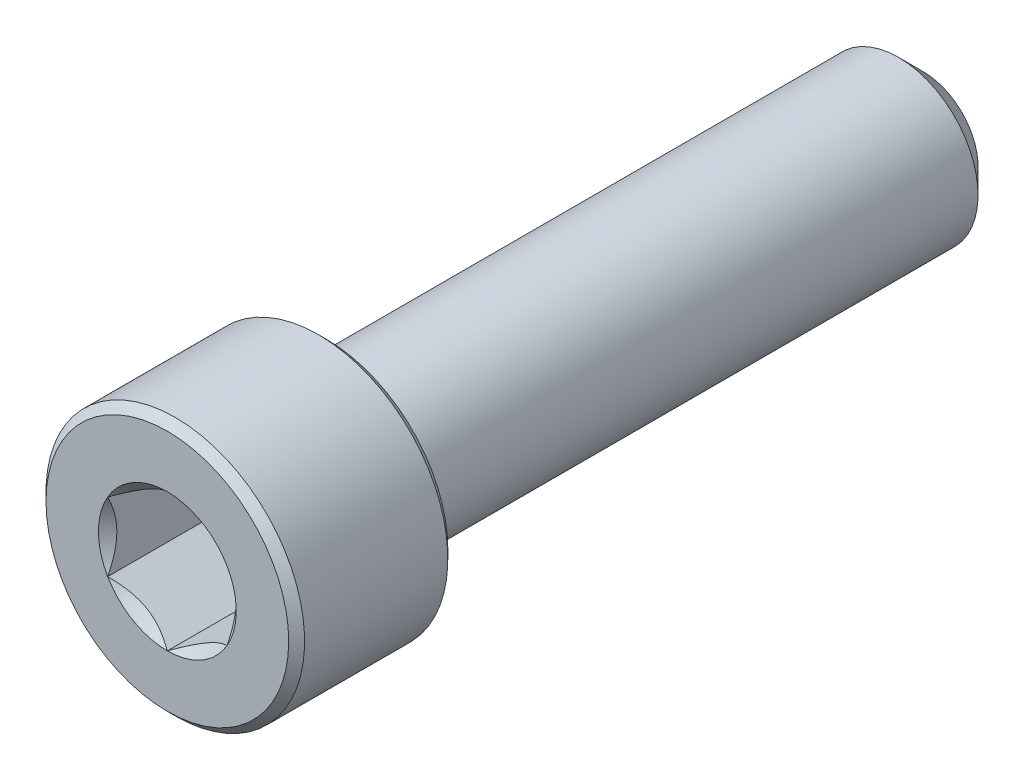
ISO-10303-21;
HEADER;
FILE_DESCRIPTION(('STEP AP214'),'2;1');
FILE_NAME('part.step','',(''),(''),'','','');
FILE_SCHEMA(('AUTOMOTIVE_DESIGN { 1 0 10303 214 1 1 1 1 }'));
ENDSEC;
DATA;
#1=APPLICATION_CONTEXT('core data for automotive mechanical design processes');
#2=APPLICATION_PROTOCOL_DEFINITION('international standard','automotive_design',2000,#1);
#3=PRODUCT_CONTEXT('',#1,'mechanical');
#4=PRODUCT('Part','Part','',(#3));
#5=PRODUCT_RELATED_PRODUCT_CATEGORY('part','',(#4));
#6=PRODUCT_DEFINITION_FORMATION('','',#4);
#7=PRODUCT_DEFINITION_CONTEXT('part definition',#1,'design');
#8=PRODUCT_DEFINITION('design','',#6,#7);
#9=PRODUCT_DEFINITION_SHAPE('','',#8);
#10=(LENGTH_UNIT() NAMED_UNIT(*) SI_UNIT(.MILLI.,.METRE.));
#11=(NAMED_UNIT(*) PLANE_ANGLE_UNIT() SI_UNIT($,.RADIAN.));
#12=(NAMED_UNIT(*) SI_UNIT($,.STERADIAN.) SOLID_ANGLE_UNIT());
#13=UNCERTAINTY_MEASURE_WITH_UNIT(LENGTH_MEASURE(1.E-05),#10,'distance_accuracy_value','');
#14=(GEOMETRIC_REPRESENTATION_CONTEXT(3) GLOBAL_UNCERTAINTY_ASSIGNED_CONTEXT((#13)) GLOBAL_UNIT_ASSIGNED_CONTEXT((#10,
#11,#12)) REPRESENTATION_CONTEXT('',''));
#15=CARTESIAN_POINT('',(0.,0.,0.));
#16=DIRECTION('',(0.,0.,1.));
#17=DIRECTION('',(1.,0.,0.));
#18=AXIS2_PLACEMENT_3D('',#15,#16,#17);
#19=CARTESIAN_POINT('',(0.,0.,19.));
#20=DIRECTION('',(0.,0.,1.));
#21=DIRECTION('',(0.,-1.,0.));
#22=AXIS2_PLACEMENT_3D('',#19,#20,#21);
#23=PLANE('',#22);
#24=CARTESIAN_POINT('',(0.,0.,19.));
#25=DIRECTION('',(0.,0.,1.));
#26=DIRECTION('',(1.,0.,0.));
#27=AXIS2_PLACEMENT_3D('',#24,#25,#26);
#28=CIRCLE('',#27,3.46410161513775);
#29=CARTESIAN_POINT('',(0.,-3.46410161513776,19.));
#30=VERTEX_POINT('',#29);
#31=CARTESIAN_POINT('',(3.,-1.73205080756888,19.));
#32=VERTEX_POINT('',#31);
#33=EDGE_CURVE('E99',#30,#32,#28,.T.);
#34=ORIENTED_EDGE('',*,*,#33,.F.);
#35=CARTESIAN_POINT('',(-3.,-1.73205080756888,19.));
#36=VERTEX_POINT('',#35);
#37=EDGE_CURVE('E269',#36,#30,#28,.T.);
#38=ORIENTED_EDGE('',*,*,#37,.F.);
#39=CARTESIAN_POINT('',(-3.,1.73205080756888,19.));
#40=VERTEX_POINT('',#39);
#41=EDGE_CURVE('E134',#40,#36,#28,.T.);
#42=ORIENTED_EDGE('',*,*,#41,.F.);
#43=CARTESIAN_POINT('',(0.,3.46410161513775,19.));
#44=VERTEX_POINT('',#43);
#45=EDGE_CURVE('E130',#44,#40,#28,.T.);
#46=ORIENTED_EDGE('',*,*,#45,.F.);
#47=CARTESIAN_POINT('',(3.,1.73205080756888,19.));
#48=VERTEX_POINT('',#47);
#49=EDGE_CURVE('E101',#48,#44,#28,.T.);
#50=ORIENTED_EDGE('',*,*,#49,.F.);
#51=EDGE_CURVE('E93',#32,#48,#28,.T.);
#52=ORIENTED_EDGE('',*,*,#51,.F.);
#53=EDGE_LOOP('',(#34,#38,#42,#46,#50,#52));
#54=FACE_BOUND('',#53,.T.);
#55=CARTESIAN_POINT('',(0.,0.,19.));
#56=DIRECTION('',(0.,0.,-1.));
#57=DIRECTION('',(0.,1.,0.));
#58=AXIS2_PLACEMENT_3D('',#55,#56,#57);
#59=CIRCLE('',#58,6.1);
#60=CARTESIAN_POINT('',(0.,6.1,19.));
#61=VERTEX_POINT('',#60);
#62=EDGE_CURVE('E49',#61,#61,#59,.T.);
#63=ORIENTED_EDGE('',*,*,#62,.F.);
#64=EDGE_LOOP('',(#63));
#65=FACE_BOUND('',#64,.T.);
#66=ADVANCED_FACE('F36',(#54,#65),#23,.T.);
#67=CARTESIAN_POINT('',(0.,0.,18.6));
#68=DIRECTION('',(0.,0.,-1.));
#69=DIRECTION('',(0.,1.,0.));
#70=AXIS2_PLACEMENT_3D('',#67,#68,#69);
#71=CONICAL_SURFACE('',#70,6.5,0.785398163397452);
#72=ORIENTED_EDGE('',*,*,#62,.T.);
#73=EDGE_LOOP('',(#72));
#74=FACE_BOUND('',#73,.T.);
#75=CARTESIAN_POINT('',(0.,0.,18.6));
#76=DIRECTION('',(0.,0.,-1.));
#77=DIRECTION('',(0.,1.,0.));
#78=AXIS2_PLACEMENT_3D('',#75,#76,#77);
#79=CIRCLE('',#78,6.5);
#80=CARTESIAN_POINT('',(0.,6.5,18.6));
#81=VERTEX_POINT('',#80);
#82=EDGE_CURVE('E220',#81,#81,#79,.T.);
#83=ORIENTED_EDGE('',*,*,#82,.F.);
#84=EDGE_LOOP('',(#83));
#85=FACE_BOUND('',#84,.T.);
#86=ADVANCED_FACE('F208',(#74,#85),#71,.T.);
#87=CARTESIAN_POINT('',(0.,0.,-19.));
#88=DIRECTION('',(0.,0.,-1.));
#89=DIRECTION('',(0.,1.,0.));
#90=AXIS2_PLACEMENT_3D('',#87,#88,#89);
#91=CYLINDRICAL_SURFACE('',#90,6.5);
#92=ORIENTED_EDGE('',*,*,#82,.T.);
#93=EDGE_LOOP('',(#92));
#94=FACE_BOUND('',#93,.T.);
#95=CARTESIAN_POINT('',(0.,0.,11.4));
#96=DIRECTION('',(0.,0.,-1.));
#97=DIRECTION('',(0.,1.,0.));
#98=AXIS2_PLACEMENT_3D('',#95,#96,#97);
#99=CIRCLE('',#98,6.5);
#100=CARTESIAN_POINT('',(0.,6.5,11.4));
#101=VERTEX_POINT('',#100);
#102=EDGE_CURVE('E221',#101,#101,#99,.T.);
#103=ORIENTED_EDGE('',*,*,#102,.F.);
#104=EDGE_LOOP('',(#103));
#105=FACE_BOUND('',#104,.T.);
#106=ADVANCED_FACE('F205',(#94,#105),#91,.T.);
#107=CARTESIAN_POINT('',(0.,0.,11.));
#108=DIRECTION('',(0.,0.,1.));
#109=DIRECTION('',(0.,-1.,0.));
#110=AXIS2_PLACEMENT_3D('',#107,#108,#109);
#111=CONICAL_SURFACE('',#110,6.1,0.785398163397452);
#112=ORIENTED_EDGE('',*,*,#102,.T.);
#113=EDGE_LOOP('',(#112));
#114=FACE_BOUND('',#113,.T.);
#115=CARTESIAN_POINT('',(0.,0.,11.));
#116=DIRECTION('',(0.,0.,-1.));
#117=DIRECTION('',(0.,1.,0.));
#118=AXIS2_PLACEMENT_3D('',#115,#116,#117);
#119=CIRCLE('',#118,6.1);
#120=CARTESIAN_POINT('',(0.,6.1,11.));
#121=VERTEX_POINT('',#120);
#122=EDGE_CURVE('E224',#121,#121,#119,.T.);
#123=ORIENTED_EDGE('',*,*,#122,.F.);
#124=EDGE_LOOP('',(#123));
#125=FACE_BOUND('',#124,.T.);
#126=ADVANCED_FACE('F201',(#114,#125),#111,.T.);
#127=CARTESIAN_POINT('',(0.,6.1,11.));
#128=DIRECTION('',(0.,0.,-1.));
#129=DIRECTION('',(0.,1.,0.));
#130=AXIS2_PLACEMENT_3D('',#127,#128,#129);
#131=PLANE('',#130);
#132=ORIENTED_EDGE('',*,*,#122,.T.);
#133=EDGE_LOOP('',(#132));
#134=FACE_BOUND('',#133,.T.);
#135=CARTESIAN_POINT('',(0.,0.,11.));
#136=DIRECTION('',(0.,0.,-1.));
#137=DIRECTION('',(0.,1.,0.));
#138=AXIS2_PLACEMENT_3D('',#135,#136,#137);
#139=CIRCLE('',#138,4.);
#140=CARTESIAN_POINT('',(0.,4.,11.));
#141=VERTEX_POINT('',#140);
#142=EDGE_CURVE('E229',#141,#141,#139,.T.);
#143=ORIENTED_EDGE('',*,*,#142,.F.);
#144=EDGE_LOOP('',(#143));
#145=FACE_BOUND('',#144,.T.);
#146=ADVANCED_FACE('F197',(#134,#145),#131,.T.);
#147=CARTESIAN_POINT('',(0.,0.,-19.));
#148=DIRECTION('',(0.,0.,-1.));
#149=DIRECTION('',(0.,1.,0.));
#150=AXIS2_PLACEMENT_3D('',#147,#148,#149);
#151=CYLINDRICAL_SURFACE('',#150,4.);
#152=ORIENTED_EDGE('',*,*,#142,.T.);
#153=EDGE_LOOP('',(#152));
#154=FACE_BOUND('',#153,.T.);
#155=CARTESIAN_POINT('',(0.,0.,-17.75));
#156=DIRECTION('',(0.,0.,-1.));
#157=DIRECTION('',(0.,1.,0.));
#158=AXIS2_PLACEMENT_3D('',#155,#156,#157);
#159=CIRCLE('',#158,4.);
#160=CARTESIAN_POINT('',(0.,4.,-17.75));
#161=VERTEX_POINT('',#160);
#162=EDGE_CURVE('E232',#161,#161,#159,.T.);
#163=ORIENTED_EDGE('',*,*,#162,.F.);
#164=EDGE_LOOP('',(#163));
#165=FACE_BOUND('',#164,.T.);
#166=ADVANCED_FACE('F193',(#154,#165),#151,.T.);
#167=CARTESIAN_POINT('',(0.,0.,-19.));
#168=DIRECTION('',(0.,0.,1.));
#169=DIRECTION('',(0.,-1.,0.));
#170=AXIS2_PLACEMENT_3D('',#167,#168,#169);
#171=CONICAL_SURFACE('',#170,2.75,0.785398163397442);
#172=ORIENTED_EDGE('',*,*,#162,.T.);
#173=EDGE_LOOP('',(#172));
#174=FACE_BOUND('',#173,.T.);
#175=CARTESIAN_POINT('',(0.,0.,-19.));
#176=DIRECTION('',(0.,0.,-1.));
#177=DIRECTION('',(0.,1.,0.));
#178=AXIS2_PLACEMENT_3D('',#175,#176,#177);
#179=CIRCLE('',#178,2.75);
#180=CARTESIAN_POINT('',(0.,2.75,-19.));
#181=VERTEX_POINT('',#180);
#182=EDGE_CURVE('E235',#181,#181,#179,.T.);
#183=ORIENTED_EDGE('',*,*,#182,.F.);
#184=EDGE_LOOP('',(#183));
#185=FACE_BOUND('',#184,.T.);
#186=ADVANCED_FACE('F189',(#174,#185),#171,.T.);
#187=CARTESIAN_POINT('',(0.,2.75,-19.));
#188=DIRECTION('',(0.,0.,-1.));
#189=DIRECTION('',(0.,1.,0.));
#190=AXIS2_PLACEMENT_3D('',#187,#188,#189);
#191=PLANE('',#190);
#192=ORIENTED_EDGE('',*,*,#182,.T.);
#193=EDGE_LOOP('',(#192));
#194=FACE_BOUND('',#193,.T.);
#195=ADVANCED_FACE('F186',(#194),#191,.T.);
#196=CARTESIAN_POINT('',(0.,0.,19.));
#197=DIRECTION('',(0.,0.,1.));
#198=DIRECTION('',(1.,0.,0.));
#199=AXIS2_PLACEMENT_3D('',#196,#197,#198);
#200=CONICAL_SURFACE('',#199,3.46410161513775,0.78539816339745);
#201=ORIENTED_EDGE('',*,*,#33,.T.);
#202=CARTESIAN_POINT('',(-0.00019999999999857,-3.46421708519159,19.0001154758271));
#203=CARTESIAN_POINT('',(0.10292351495575,-3.40467869607211,18.9406283183218));
#204=CARTESIAN_POINT('',(0.207771389330652,-3.3441447475778,18.8846349794655));
#205=CARTESIAN_POINT('',(0.421567671781098,-3.22070940635329,18.7821125963789));
#206=CARTESIAN_POINT('',(0.530536411379762,-3.15779627521275,18.7356405937413));
#207=CARTESIAN_POINT('',(0.750266639597031,-3.03093496880241,18.6560331885163));
#208=CARTESIAN_POINT('',(0.860972171762214,-2.96701910000606,18.6226977006427));
#209=CARTESIAN_POINT('',(1.08482041056533,-2.83778025907546,18.5713375439793));
#210=CARTESIAN_POINT('',(1.197956279207,-2.77246123486019,18.5532745375356));
#211=CARTESIAN_POINT('',(1.3929409561927,-2.65988677911464,18.5369769084505));
#212=CARTESIAN_POINT('',(1.47453795400214,-2.6127767304643,18.5345643671738));
#213=CARTESIAN_POINT('',(1.63759922883009,-2.51863325954798,18.5386294346571));
#214=CARTESIAN_POINT('',(1.71906344929899,-2.47159986993094,18.5451101600283));
#215=CARTESIAN_POINT('',(1.88122011233837,-2.37797867687426,18.5665917225152));
#216=CARTESIAN_POINT('',(1.96191158878431,-2.33139143122689,18.5816020899673));
#217=CARTESIAN_POINT('',(2.12190869789134,-2.23901705721438,18.619323646066));
#218=CARTESIAN_POINT('',(2.2012144363093,-2.19322986779049,18.6420342443228));
#219=CARTESIAN_POINT('',(2.34200614080276,-2.11194373930153,18.6887606848539));
#220=CARTESIAN_POINT('',(2.40380372214603,-2.07626488907772,18.7115483276808));
#221=CARTESIAN_POINT('',(2.52628941752022,-2.00554773988155,18.7607962860574));
#222=CARTESIAN_POINT('',(2.58697749763561,-1.97050946049033,18.7872567136662));
#223=CARTESIAN_POINT('',(2.70705299739086,-1.90118383838356,18.8432569943914));
#224=CARTESIAN_POINT('',(2.76644383229592,-1.86689452386373,18.8727871644784));
#225=CARTESIAN_POINT('',(2.88412556146727,-1.79895094584795,18.9345390915755));
#226=CARTESIAN_POINT('',(2.94241710424773,-1.76529630793217,18.9667591966594));
#227=CARTESIAN_POINT('',(3.0002,-1.73193533751504,19.0001154758271));
#228=B_SPLINE_CURVE_WITH_KNOTS('',3,(#202,#203,#204,#205,#206,#207,#208,#209,#210,#211,#212,
#213,#214,#215,#216,#217,#218,#219,#220,#221,#222,#223,#224,#225,#226,#227),.UNSPECIFIED.,.F.,
.F.,(4,2,2,2,2,2,2,2,2,2,2,2,4),(0.,0.399603557139306,0.801535286397846,1.19708369162343,
1.59163620080173,1.87398941755844,2.15644160919093,2.43921001247425,2.72195674032138,
2.94657516661927,3.17120044767274,3.3951375283781,3.61893808380739),.UNSPECIFIED.);
#229=EDGE_CURVE('E12',#30,#32,#228,.T.);
#230=ORIENTED_EDGE('',*,*,#229,.F.);
#231=EDGE_LOOP('',(#201,#230));
#232=FACE_BOUND('',#231,.T.);
#233=ADVANCED_FACE('F152',(#232),#200,.F.);
#234=ORIENTED_EDGE('',*,*,#37,.T.);
#235=CARTESIAN_POINT('',(-3.0002,-1.73193533751504,19.0001154758271));
#236=CARTESIAN_POINT('',(-2.89707648504425,-1.79147372663452,18.9406283183218));
#237=CARTESIAN_POINT('',(-2.79222861066935,-1.85200767512883,18.8846349794655));
#238=CARTESIAN_POINT('',(-2.5784323282189,-1.97544301635334,18.7821125963789));
#239=CARTESIAN_POINT('',(-2.46946358862024,-2.03835614749388,18.7356405937413));
#240=CARTESIAN_POINT('',(-2.24973336040297,-2.16521745390422,18.6560331885163));
#241=CARTESIAN_POINT('',(-2.13902782823779,-2.22913332270057,18.6226977006427));
#242=CARTESIAN_POINT('',(-1.91517958943467,-2.35837216363117,18.5713375439793));
#243=CARTESIAN_POINT('',(-1.802043720793,-2.42369118784644,18.5532745375356));
#244=CARTESIAN_POINT('',(-1.6070590438073,-2.53626564359199,18.5369769084505));
#245=CARTESIAN_POINT('',(-1.52546204599786,-2.58337569224233,18.5345643671738));
#246=CARTESIAN_POINT('',(-1.36240077116991,-2.67751916315865,18.5386294346571));
#247=CARTESIAN_POINT('',(-1.28093655070101,-2.7245525527757,18.5451101600283));
#248=CARTESIAN_POINT('',(-1.11877988766163,-2.81817374583238,18.5665917225152));
#249=CARTESIAN_POINT('',(-1.03808841121569,-2.86476099147974,18.5816020899673));
#250=CARTESIAN_POINT('',(-0.878091302108662,-2.95713536549225,18.619323646066));
#251=CARTESIAN_POINT('',(-0.798785563690701,-3.00292255491614,18.6420342443228));
#252=CARTESIAN_POINT('',(-0.657993859197244,-3.0842086834051,18.6887606848539));
#253=CARTESIAN_POINT('',(-0.596196277853971,-3.11988753362891,18.7115483276808));
#254=CARTESIAN_POINT('',(-0.473710582479778,-3.19060468282508,18.7607962860574));
#255=CARTESIAN_POINT('',(-0.413022502364395,-3.2256429622163,18.7872567136662));
#256=CARTESIAN_POINT('',(-0.292947002609136,-3.29496858432308,18.8432569943914));
#257=CARTESIAN_POINT('',(-0.233556167704082,-3.32925789884291,18.8727871644784));
#258=CARTESIAN_POINT('',(-0.115874438532732,-3.39720147685869,18.9345390915755));
#259=CARTESIAN_POINT('',(-0.0575828957522662,-3.43085611477447,18.9667591966594));
#260=CARTESIAN_POINT('',(0.000199999999999969,-3.46421708519159,19.0001154758271));
#261=B_SPLINE_CURVE_WITH_KNOTS('',3,(#235,#236,#237,#238,#239,#240,#241,#242,#243,#244,#245,
#246,#247,#248,#249,#250,#251,#252,#253,#254,#255,#256,#257,#258,#259,#260),.UNSPECIFIED.,.F.,
.F.,(4,2,2,2,2,2,2,2,2,2,2,2,4),(0.,0.399603557139308,0.801535286397846,1.19708369162343,
1.59163620080173,1.87398941755844,2.15644160919093,2.43921001247425,2.72195674032138,
2.94657516661927,3.17120044767274,3.3951375283781,3.61893808380739),.UNSPECIFIED.);
#262=EDGE_CURVE('E131',#36,#30,#261,.T.);
#263=ORIENTED_EDGE('',*,*,#262,.F.);
#264=EDGE_LOOP('',(#234,#263));
#265=FACE_BOUND('',#264,.T.);
#266=ADVANCED_FACE('F267',(#265),#200,.F.);
#267=ORIENTED_EDGE('',*,*,#41,.T.);
#268=CARTESIAN_POINT('',(-3.,-3.45441625939385,20.1111570325416));
#269=CARTESIAN_POINT('',(-3.,-3.37030502107638,20.0476657232794));
#270=CARTESIAN_POINT('',(-3.,-3.28572284861355,19.9847881417678));
#271=CARTESIAN_POINT('',(-3.,-3.11543086688957,19.8605352202182));
#272=CARTESIAN_POINT('',(-3.,-3.02972077988559,19.7991602612535));
#273=CARTESIAN_POINT('',(-3.,-2.8563602330365,19.6777509975778));
#274=CARTESIAN_POINT('',(-3.,-2.76869988431322,19.6177307653415));
#275=CARTESIAN_POINT('',(-3.,-2.5918912487671,19.4999306126985));
#276=CARTESIAN_POINT('',(-3.,-2.50274306770574,19.4421505340141));
#277=CARTESIAN_POINT('',(-3.,-2.31756329845857,19.3260958713429));
#278=CARTESIAN_POINT('',(-3.,-2.22143002198058,19.2679827190468));
#279=CARTESIAN_POINT('',(-3.,-2.02694739151963,19.1555968716429));
#280=CARTESIAN_POINT('',(-3.,-1.92859833207453,19.101323670026));
#281=CARTESIAN_POINT('',(-3.,-1.7296520236116,18.9977624496109));
#282=CARTESIAN_POINT('',(-3.,-1.62906211119816,18.9484604472253));
#283=CARTESIAN_POINT('',(-3.,-1.42513893302447,18.855954239299));
#284=CARTESIAN_POINT('',(-3.,-1.3218069347663,18.8127472727735));
#285=CARTESIAN_POINT('',(-3.,-1.12067434078031,18.7371396932414));
#286=CARTESIAN_POINT('',(-3.,-1.02309778507454,18.7041492645284));
#287=CARTESIAN_POINT('',(-3.,-0.825595420969993,18.6459965369441));
#288=CARTESIAN_POINT('',(-3.,-0.725669451239074,18.620834777359));
#289=CARTESIAN_POINT('',(-3.,-0.525726947792027,18.5800719953195));
#290=CARTESIAN_POINT('',(-3.,-0.425744363617326,18.5643071649568));
#291=CARTESIAN_POINT('',(-3.,-0.224710351161198,18.5426442284558));
#292=CARTESIAN_POINT('',(-3.,-0.123659109618514,18.5367444262465));
#293=CARTESIAN_POINT('',(-3.,0.0748582819677237,18.5352497065848));
#294=CARTESIAN_POINT('',(-3.,0.172321806608345,18.5392895256711));
#295=CARTESIAN_POINT('',(-3.,0.366414003342316,18.5566450472329));
#296=CARTESIAN_POINT('',(-3.,0.463042593410415,18.5699616508163));
#297=CARTESIAN_POINT('',(-3.,0.656399252511053,18.6053707356158));
#298=CARTESIAN_POINT('',(-3.,0.753099531688679,18.6276125600194));
#299=CARTESIAN_POINT('',(-3.,0.944393095040882,18.6796858906705));
#300=CARTESIAN_POINT('',(-3.,1.03898655479587,18.7095167618603));
#301=CARTESIAN_POINT('',(-3.,1.23463961000382,18.7786113636965));
#302=CARTESIAN_POINT('',(-3.,1.33547771428671,18.8184959734906));
#303=CARTESIAN_POINT('',(-3.,1.53452137874292,18.9043830232129));
#304=CARTESIAN_POINT('',(-3.,1.63272604345161,18.9503875132043));
#305=CARTESIAN_POINT('',(-3.,1.82700394280656,19.0474277014877));
#306=CARTESIAN_POINT('',(-3.,1.92306904045365,19.0984795592876));
#307=CARTESIAN_POINT('',(-3.,2.11298650428611,19.2044820100322));
#308=CARTESIAN_POINT('',(-3.,2.20683926516496,19.259431900424));
#309=CARTESIAN_POINT('',(-3.,2.38800606865125,19.3696520775105));
#310=CARTESIAN_POINT('',(-3.,2.47541308656128,19.4247703488088));
#311=CARTESIAN_POINT('',(-3.,2.64872655468151,19.5373247081957));
#312=CARTESIAN_POINT('',(-3.,2.73463289052352,19.5947609718457));
#313=CARTESIAN_POINT('',(-3.,2.90444477939853,19.7110625667455));
#314=CARTESIAN_POINT('',(-3.,2.9883609164946,19.7699124995692));
#315=CARTESIAN_POINT('',(-3.,3.15504638145619,19.8891686606219));
#316=CARTESIAN_POINT('',(-3.,3.23781601834663,19.9495744564211));
#317=CARTESIAN_POINT('',(-3.,3.32010556038988,20.0106163572189));
#318=B_SPLINE_CURVE_WITH_KNOTS('',3,(#268,#269,#270,#271,#272,#273,#274,#275,#276,#277,#278,
#279,#280,#281,#282,#283,#284,#285,#286,#287,#288,#289,#290,#291,#292,#293,#294,#295,#296,#297,
#298,#299,#300,#301,#302,#303,#304,#305,#306,#307,#308,#309,#310,#311,#312,#313,#314,#315,#316,
#317),.UNSPECIFIED.,.F.,.F.,(4,2,2,2,2,2,2,2,2,2,2,2,2,2,2,2,2,2,2,2,2,2,2,2,4),(0.,
0.316159097965335,0.632397561987885,0.951086331935232,1.26975254380526,1.60668135057622,
1.94356563154895,2.27947417466659,2.61523006286276,2.9239666521912,3.23272450446297,
3.53592945807761,3.83908227702019,4.13126225384143,4.42347061576031,4.72078712232687,
5.01807875738361,5.34314370606637,5.66831782186803,5.99456896834931,6.32076146236873,
6.63072186382905,6.94070578545817,7.2481716702137,7.55555300225563),.UNSPECIFIED.);
#319=EDGE_CURVE('E132',#40,#36,#318,.F.);
#320=ORIENTED_EDGE('',*,*,#319,.F.);
#321=EDGE_LOOP('',(#267,#320));
#322=FACE_BOUND('',#321,.T.);
#323=ADVANCED_FACE('F272',(#322),#200,.F.);
#324=ORIENTED_EDGE('',*,*,#45,.T.);
#325=CARTESIAN_POINT('',(0.000199999999999346,3.46421708519159,19.0001154758271));
#326=CARTESIAN_POINT('',(-0.102923514955749,3.40467869607211,18.9406283183218));
#327=CARTESIAN_POINT('',(-0.207771389330651,3.3441447475778,18.8846349794655));
#328=CARTESIAN_POINT('',(-0.421567671781097,3.22070940635329,18.7821125963789));
#329=CARTESIAN_POINT('',(-0.530536411379761,3.15779627521275,18.7356405937413));
#330=CARTESIAN_POINT('',(-0.75026663959703,3.03093496880241,18.6560331885163));
#331=CARTESIAN_POINT('',(-0.860972171762213,2.96701910000606,18.6226977006427));
#332=CARTESIAN_POINT('',(-1.08482041056533,2.83778025907546,18.5713375439793));
#333=CARTESIAN_POINT('',(-1.197956279207,2.77246123486019,18.5532745375356));
#334=CARTESIAN_POINT('',(-1.3929409561927,2.65988677911464,18.5369769084505));
#335=CARTESIAN_POINT('',(-1.47453795400214,2.6127767304643,18.5345643671738));
#336=CARTESIAN_POINT('',(-1.63759922883009,2.51863325954798,18.5386294346571));
#337=CARTESIAN_POINT('',(-1.71906344929899,2.47159986993093,18.5451101600283));
#338=CARTESIAN_POINT('',(-1.88122011233837,2.37797867687426,18.5665917225152));
#339=CARTESIAN_POINT('',(-1.9619115887843,2.33139143122689,18.5816020899673));
#340=CARTESIAN_POINT('',(-2.12190869789134,2.23901705721438,18.619323646066));
#341=CARTESIAN_POINT('',(-2.2012144363093,2.19322986779049,18.6420342443228));
#342=CARTESIAN_POINT('',(-2.34200614080276,2.11194373930153,18.6887606848539));
#343=CARTESIAN_POINT('',(-2.40380372214603,2.07626488907772,18.7115483276808));
#344=CARTESIAN_POINT('',(-2.52628941752022,2.00554773988155,18.7607962860574));
#345=CARTESIAN_POINT('',(-2.5869774976356,1.97050946049033,18.7872567136662));
#346=CARTESIAN_POINT('',(-2.70705299739086,1.90118383838355,18.8432569943914));
#347=CARTESIAN_POINT('',(-2.76644383229592,1.86689452386372,18.8727871644784));
#348=CARTESIAN_POINT('',(-2.88412556146727,1.79895094584794,18.9345390915755));
#349=CARTESIAN_POINT('',(-2.94241710424773,1.76529630793216,18.9667591966594));
#350=CARTESIAN_POINT('',(-3.0002,1.73193533751504,19.0001154758271));
#351=B_SPLINE_CURVE_WITH_KNOTS('',3,(#325,#326,#327,#328,#329,#330,#331,#332,#333,#334,#335,
#336,#337,#338,#339,#340,#341,#342,#343,#344,#345,#346,#347,#348,#349,#350),.UNSPECIFIED.,.F.,
.F.,(4,2,2,2,2,2,2,2,2,2,2,2,4),(0.,0.399603557139306,0.801535286397845,1.19708369162343,
1.59163620080173,1.87398941755844,2.15644160919093,2.43921001247425,2.72195674032138,
2.94657516661927,3.17120044767274,3.3951375283781,3.61893808380739),.UNSPECIFIED.);
#352=EDGE_CURVE('E111',#44,#40,#351,.T.);
#353=ORIENTED_EDGE('',*,*,#352,.F.);
#354=EDGE_LOOP('',(#324,#353));
#355=FACE_BOUND('',#354,.T.);
#356=ADVANCED_FACE('F306',(#355),#200,.F.);
#357=ORIENTED_EDGE('',*,*,#49,.T.);
#358=CARTESIAN_POINT('',(3.0002,1.73193533751504,19.0001154758271));
#359=CARTESIAN_POINT('',(2.89707648504425,1.79147372663452,18.9406283183218));
#360=CARTESIAN_POINT('',(2.79222861066935,1.85200767512883,18.8846349794655));
#361=CARTESIAN_POINT('',(2.5784323282189,1.97544301635334,18.7821125963789));
#362=CARTESIAN_POINT('',(2.46946358862024,2.03835614749388,18.7356405937413));
#363=CARTESIAN_POINT('',(2.24973336040297,2.16521745390422,18.6560331885163));
#364=CARTESIAN_POINT('',(2.13902782823779,2.22913332270057,18.6226977006427));
#365=CARTESIAN_POINT('',(1.91517958943467,2.35837216363117,18.5713375439793));
#366=CARTESIAN_POINT('',(1.80204372079301,2.42369118784644,18.5532745375356));
#367=CARTESIAN_POINT('',(1.6070590438073,2.53626564359199,18.5369769084505));
#368=CARTESIAN_POINT('',(1.52546204599787,2.58337569224233,18.5345643671738));
#369=CARTESIAN_POINT('',(1.36240077116991,2.67751916315865,18.5386294346571));
#370=CARTESIAN_POINT('',(1.28093655070101,2.7245525527757,18.5451101600283));
#371=CARTESIAN_POINT('',(1.11877988766163,2.81817374583237,18.5665917225152));
#372=CARTESIAN_POINT('',(1.0380884112157,2.86476099147974,18.5816020899673));
#373=CARTESIAN_POINT('',(0.878091302108664,2.95713536549225,18.619323646066));
#374=CARTESIAN_POINT('',(0.798785563690703,3.00292255491614,18.6420342443228));
#375=CARTESIAN_POINT('',(0.657993859197245,3.0842086834051,18.6887606848539));
#376=CARTESIAN_POINT('',(0.596196277853972,3.11988753362891,18.7115483276808));
#377=CARTESIAN_POINT('',(0.473710582479778,3.19060468282508,18.7607962860574));
#378=CARTESIAN_POINT('',(0.413022502364395,3.2256429622163,18.7872567136662));
#379=CARTESIAN_POINT('',(0.292947002609136,3.29496858432308,18.8432569943914));
#380=CARTESIAN_POINT('',(0.233556167704081,3.32925789884291,18.8727871644784));
#381=CARTESIAN_POINT('',(0.115874438532731,3.39720147685868,18.9345390915755));
#382=CARTESIAN_POINT('',(0.0575828957522655,3.43085611477446,18.9667591966594));
#383=CARTESIAN_POINT('',(-0.0002000000000005,3.46421708519159,19.0001154758271));
#384=B_SPLINE_CURVE_WITH_KNOTS('',3,(#358,#359,#360,#361,#362,#363,#364,#365,#366,#367,#368,
#369,#370,#371,#372,#373,#374,#375,#376,#377,#378,#379,#380,#381,#382,#383),.UNSPECIFIED.,.F.,
.F.,(4,2,2,2,2,2,2,2,2,2,2,2,4),(0.,0.399603557139306,0.801535286397846,1.19708369162343,
1.59163620080173,1.87398941755844,2.15644160919093,2.43921001247425,2.72195674032138,
2.94657516661927,3.17120044767274,3.3951375283781,3.61893808380739),.UNSPECIFIED.);
#385=EDGE_CURVE('E104',#48,#44,#384,.T.);
#386=ORIENTED_EDGE('',*,*,#385,.F.);
#387=EDGE_LOOP('',(#357,#386));
#388=FACE_BOUND('',#387,.T.);
#389=ADVANCED_FACE('F105',(#388),#200,.F.);
#390=ORIENTED_EDGE('',*,*,#51,.T.);
#391=CARTESIAN_POINT('',(3.,-3.45441625939385,20.1111570325416));
#392=CARTESIAN_POINT('',(3.,-3.37030502107637,20.0476657232794));
#393=CARTESIAN_POINT('',(3.,-3.28572284861355,19.9847881417678));
#394=CARTESIAN_POINT('',(3.,-3.11543086688957,19.8605352202182));
#395=CARTESIAN_POINT('',(3.,-3.02972077988559,19.7991602612535));
#396=CARTESIAN_POINT('',(3.,-2.85636023303649,19.6777509975778));
#397=CARTESIAN_POINT('',(3.,-2.76869988431322,19.6177307653415));
#398=CARTESIAN_POINT('',(3.,-2.5918912487671,19.4999306126985));
#399=CARTESIAN_POINT('',(3.,-2.50274306770574,19.4421505340141));
#400=CARTESIAN_POINT('',(3.,-2.31756329845857,19.3260958713429));
#401=CARTESIAN_POINT('',(3.,-2.22143002198058,19.2679827190468));
#402=CARTESIAN_POINT('',(3.,-2.02694739151963,19.1555968716429));
#403=CARTESIAN_POINT('',(3.,-1.92859833207452,19.101323670026));
#404=CARTESIAN_POINT('',(3.,-1.7296520236116,18.9977624496109));
#405=CARTESIAN_POINT('',(3.,-1.62906211119816,18.9484604472253));
#406=CARTESIAN_POINT('',(3.,-1.42513893302447,18.855954239299));
#407=CARTESIAN_POINT('',(3.,-1.3218069347663,18.8127472727735));
#408=CARTESIAN_POINT('',(3.,-1.12067434078031,18.7371396932414));
#409=CARTESIAN_POINT('',(3.,-1.02309778507454,18.7041492645284));
#410=CARTESIAN_POINT('',(3.,-0.82559542096999,18.6459965369441));
#411=CARTESIAN_POINT('',(3.,-0.725669451239071,18.620834777359));
#412=CARTESIAN_POINT('',(3.,-0.525726947792024,18.5800719953195));
#413=CARTESIAN_POINT('',(3.,-0.425744363617322,18.5643071649568));
#414=CARTESIAN_POINT('',(3.,-0.224710351161193,18.5426442284558));
#415=CARTESIAN_POINT('',(3.,-0.123659109618509,18.5367444262465));
#416=CARTESIAN_POINT('',(3.,0.0748582819677289,18.5352497065848));
#417=CARTESIAN_POINT('',(3.,0.17232180660835,18.5392895256711));
#418=CARTESIAN_POINT('',(3.,0.366414003342321,18.5566450472329));
#419=CARTESIAN_POINT('',(3.,0.46304259341042,18.5699616508163));
#420=CARTESIAN_POINT('',(3.,0.656399252511058,18.6053707356158));
#421=CARTESIAN_POINT('',(3.,0.753099531688683,18.6276125600194));
#422=CARTESIAN_POINT('',(3.,0.944393095040886,18.6796858906705));
#423=CARTESIAN_POINT('',(3.,1.03898655479587,18.7095167618603));
#424=CARTESIAN_POINT('',(3.,1.23463961000382,18.7786113636965));
#425=CARTESIAN_POINT('',(3.,1.33547771428672,18.8184959734906));
#426=CARTESIAN_POINT('',(3.,1.53452137874292,18.9043830232129));
#427=CARTESIAN_POINT('',(3.,1.63272604345162,18.9503875132043));
#428=CARTESIAN_POINT('',(3.,1.82700394280657,19.0474277014878));
#429=CARTESIAN_POINT('',(3.,1.92306904045366,19.0984795592876));
#430=CARTESIAN_POINT('',(3.,2.11298650428612,19.2044820100323));
#431=CARTESIAN_POINT('',(3.,2.20683926516497,19.259431900424));
#432=CARTESIAN_POINT('',(3.,2.38800606865125,19.3696520775106));
#433=CARTESIAN_POINT('',(3.,2.47541308656129,19.4247703488088));
#434=CARTESIAN_POINT('',(3.,2.64872655468151,19.5373247081957));
#435=CARTESIAN_POINT('',(3.,2.73463289052353,19.5947609718457));
#436=CARTESIAN_POINT('',(3.,2.90444477939854,19.7110625667455));
#437=CARTESIAN_POINT('',(3.,2.98836091649461,19.7699124995692));
#438=CARTESIAN_POINT('',(3.,3.1550463814562,19.8891686606219));
#439=CARTESIAN_POINT('',(3.,3.23781601834664,19.9495744564211));
#440=CARTESIAN_POINT('',(3.,3.32010556038989,20.0106163572189));
#441=B_SPLINE_CURVE_WITH_KNOTS('',3,(#391,#392,#393,#394,#395,#396,#397,#398,#399,#400,#401,
#402,#403,#404,#405,#406,#407,#408,#409,#410,#411,#412,#413,#414,#415,#416,#417,#418,#419,#420,
#421,#422,#423,#424,#425,#426,#427,#428,#429,#430,#431,#432,#433,#434,#435,#436,#437,#438,#439,
#440),.UNSPECIFIED.,.F.,.F.,(4,2,2,2,2,2,2,2,2,2,2,2,2,2,2,2,2,2,2,2,2,2,2,2,4),(0.,
0.316159097965335,0.632397561987884,0.951086331935231,1.26975254380526,1.60668135057622,
1.94356563154894,2.27947417466659,2.61523006286276,2.9239666521912,3.23272450446297,
3.53592945807762,3.83908227702019,4.13126225384143,4.42347061576031,4.72078712232687,
5.01807875738361,5.34314370606638,5.66831782186803,5.99456896834931,6.32076146236873,
6.63072186382906,6.94070578545818,7.24817167021371,7.55555300225564),.UNSPECIFIED.);
#442=EDGE_CURVE('E55',#32,#48,#441,.T.);
#443=ORIENTED_EDGE('',*,*,#442,.F.);
#444=EDGE_LOOP('',(#390,#443));
#445=FACE_BOUND('',#444,.T.);
#446=ADVANCED_FACE('F95',(#445),#200,.F.);
#447=CARTESIAN_POINT('',(0.,6.1,12.));
#448=DIRECTION('',(0.,0.,-1.));
#449=DIRECTION('',(0.,1.,0.));
#450=AXIS2_PLACEMENT_3D('',#447,#448,#449);
#451=PLANE('',#450);
#452=DIRECTION('',(0.866025403784439,0.5,0.));
#453=VECTOR('',#452,1.);
#454=CARTESIAN_POINT('',(0.,-3.46410161513775,12.));
#455=LINE('',#454,#453);
#456=CARTESIAN_POINT('',(0.,-3.46410161513775,12.));
#457=VERTEX_POINT('',#456);
#458=CARTESIAN_POINT('',(3.,-1.73205080756888,12.));
#459=VERTEX_POINT('',#458);
#460=EDGE_CURVE('E238',#457,#459,#455,.T.);
#461=ORIENTED_EDGE('',*,*,#460,.T.);
#462=DIRECTION('',(0.,1.,0.));
#463=VECTOR('',#462,1.);
#464=CARTESIAN_POINT('',(3.,-1.73205080756888,12.));
#465=LINE('',#464,#463);
#466=CARTESIAN_POINT('',(3.,1.73205080756888,12.));
#467=VERTEX_POINT('',#466);
#468=EDGE_CURVE('E121',#459,#467,#465,.T.);
#469=ORIENTED_EDGE('',*,*,#468,.T.);
#470=DIRECTION('',(-0.866025403784439,0.5,0.));
#471=VECTOR('',#470,1.);
#472=CARTESIAN_POINT('',(3.,1.73205080756888,12.));
#473=LINE('',#472,#471);
#474=CARTESIAN_POINT('',(0.,3.46410161513775,12.));
#475=VERTEX_POINT('',#474);
#476=EDGE_CURVE('E125',#467,#475,#473,.T.);
#477=ORIENTED_EDGE('',*,*,#476,.T.);
#478=DIRECTION('',(-0.866025403784438,-0.5,0.));
#479=VECTOR('',#478,1.);
#480=CARTESIAN_POINT('',(0.,3.46410161513775,12.));
#481=LINE('',#480,#479);
#482=CARTESIAN_POINT('',(-3.,1.73205080756888,12.));
#483=VERTEX_POINT('',#482);
#484=EDGE_CURVE('E242',#475,#483,#481,.T.);
#485=ORIENTED_EDGE('',*,*,#484,.T.);
#486=DIRECTION('',(0.,-1.,0.));
#487=VECTOR('',#486,1.);
#488=CARTESIAN_POINT('',(-3.,1.73205080756888,12.));
#489=LINE('',#488,#487);
#490=CARTESIAN_POINT('',(-3.,-1.73205080756888,12.));
#491=VERTEX_POINT('',#490);
#492=EDGE_CURVE('E246',#483,#491,#489,.T.);
#493=ORIENTED_EDGE('',*,*,#492,.T.);
#494=DIRECTION('',(0.866025403784439,-0.5,0.));
#495=VECTOR('',#494,1.);
#496=CARTESIAN_POINT('',(-3.,-1.73205080756888,12.));
#497=LINE('',#496,#495);
#498=EDGE_CURVE('E248',#491,#457,#497,.T.);
#499=ORIENTED_EDGE('',*,*,#498,.T.);
#500=EDGE_LOOP('',(#461,#469,#477,#485,#493,#499));
#501=FACE_BOUND('',#500,.T.);
#502=ADVANCED_FACE('F151',(#501),#451,.F.);
#503=CARTESIAN_POINT('',(0.,-3.46410161513775,1.83484861008832));
#504=DIRECTION('',(0.5,-0.866025403784438,0.));
#505=DIRECTION('',(0.866025403784439,0.5,0.));
#506=AXIS2_PLACEMENT_3D('',#503,#504,#505);
#507=PLANE('',#506);
#508=DIRECTION('',(0.,0.,1.));
#509=VECTOR('',#508,1.);
#510=CARTESIAN_POINT('',(0.,-3.46410161513775,1.83484861008832));
#511=LINE('',#510,#509);
#512=EDGE_CURVE('E249',#457,#30,#511,.T.);
#513=ORIENTED_EDGE('',*,*,#512,.T.);
#514=ORIENTED_EDGE('',*,*,#229,.T.);
#515=DIRECTION('',(0.,0.,1.));
#516=VECTOR('',#515,1.);
#517=CARTESIAN_POINT('',(3.,-1.73205080756888,1.83484861008832));
#518=LINE('',#517,#516);
#519=EDGE_CURVE('E120',#459,#32,#518,.T.);
#520=ORIENTED_EDGE('',*,*,#519,.F.);
#521=ORIENTED_EDGE('',*,*,#460,.F.);
#522=EDGE_LOOP('',(#513,#514,#520,#521));
#523=FACE_BOUND('',#522,.T.);
#524=ADVANCED_FACE('F153',(#523),#507,.F.);
#525=CARTESIAN_POINT('',(-3.,-1.73205080756888,1.83484861008832));
#526=DIRECTION('',(-0.5,-0.866025403784439,0.));
#527=DIRECTION('',(0.866025403784439,-0.5,0.));
#528=AXIS2_PLACEMENT_3D('',#525,#526,#527);
#529=PLANE('',#528);
#530=DIRECTION('',(0.,0.,1.));
#531=VECTOR('',#530,1.);
#532=CARTESIAN_POINT('',(-3.,-1.73205080756888,1.83484861008832));
#533=LINE('',#532,#531);
#534=EDGE_CURVE('E63',#491,#36,#533,.T.);
#535=ORIENTED_EDGE('',*,*,#534,.T.);
#536=ORIENTED_EDGE('',*,*,#262,.T.);
#537=ORIENTED_EDGE('',*,*,#512,.F.);
#538=ORIENTED_EDGE('',*,*,#498,.F.);
#539=EDGE_LOOP('',(#535,#536,#537,#538));
#540=FACE_BOUND('',#539,.T.);
#541=ADVANCED_FACE('F147',(#540),#529,.F.);
#542=CARTESIAN_POINT('',(-3.,1.73205080756888,1.83484861008832));
#543=DIRECTION('',(-1.,0.,0.));
#544=DIRECTION('',(0.,-1.,0.));
#545=AXIS2_PLACEMENT_3D('',#542,#543,#544);
#546=PLANE('',#545);
#547=DIRECTION('',(0.,0.,1.));
#548=VECTOR('',#547,1.);
#549=CARTESIAN_POINT('',(-3.,1.73205080756888,1.83484861008832));
#550=LINE('',#549,#548);
#551=EDGE_CURVE('E243',#483,#40,#550,.T.);
#552=ORIENTED_EDGE('',*,*,#551,.T.);
#553=ORIENTED_EDGE('',*,*,#319,.T.);
#554=ORIENTED_EDGE('',*,*,#534,.F.);
#555=ORIENTED_EDGE('',*,*,#492,.F.);
#556=EDGE_LOOP('',(#552,#553,#554,#555));
#557=FACE_BOUND('',#556,.T.);
#558=ADVANCED_FACE('F278',(#557),#546,.F.);
#559=CARTESIAN_POINT('',(0.,3.46410161513775,1.83484861008832));
#560=DIRECTION('',(-0.5,0.866025403784438,0.));
#561=DIRECTION('',(-0.866025403784438,-0.5,0.));
#562=AXIS2_PLACEMENT_3D('',#559,#560,#561);
#563=PLANE('',#562);
#564=DIRECTION('',(0.,0.,1.));
#565=VECTOR('',#564,1.);
#566=CARTESIAN_POINT('',(0.,3.46410161513775,1.83484861008832));
#567=LINE('',#566,#565);
#568=EDGE_CURVE('E240',#475,#44,#567,.T.);
#569=ORIENTED_EDGE('',*,*,#568,.T.);
#570=ORIENTED_EDGE('',*,*,#352,.T.);
#571=ORIENTED_EDGE('',*,*,#551,.F.);
#572=ORIENTED_EDGE('',*,*,#484,.F.);
#573=EDGE_LOOP('',(#569,#570,#571,#572));
#574=FACE_BOUND('',#573,.T.);
#575=ADVANCED_FACE('F178',(#574),#563,.F.);
#576=CARTESIAN_POINT('',(3.,1.73205080756888,1.83484861008832));
#577=DIRECTION('',(0.5,0.866025403784439,0.));
#578=DIRECTION('',(-0.866025403784439,0.5,0.));
#579=AXIS2_PLACEMENT_3D('',#576,#577,#578);
#580=PLANE('',#579);
#581=DIRECTION('',(0.,0.,1.));
#582=VECTOR('',#581,1.);
#583=CARTESIAN_POINT('',(3.,1.73205080756888,1.83484861008832));
#584=LINE('',#583,#582);
#585=EDGE_CURVE('E117',#467,#48,#584,.T.);
#586=ORIENTED_EDGE('',*,*,#585,.T.);
#587=ORIENTED_EDGE('',*,*,#385,.T.);
#588=ORIENTED_EDGE('',*,*,#568,.F.);
#589=ORIENTED_EDGE('',*,*,#476,.F.);
#590=EDGE_LOOP('',(#586,#587,#588,#589));
#591=FACE_BOUND('',#590,.T.);
#592=ADVANCED_FACE('F123',(#591),#580,.F.);
#593=CARTESIAN_POINT('',(3.,-1.73205080756888,1.83484861008832));
#594=DIRECTION('',(1.,0.,0.));
#595=DIRECTION('',(0.,0.,-1.));
#596=AXIS2_PLACEMENT_3D('',#593,#594,#595);
#597=PLANE('',#596);
#598=ORIENTED_EDGE('',*,*,#519,.T.);
#599=ORIENTED_EDGE('',*,*,#442,.T.);
#600=ORIENTED_EDGE('',*,*,#585,.F.);
#601=ORIENTED_EDGE('',*,*,#468,.F.);
#602=EDGE_LOOP('',(#598,#599,#600,#601));
#603=FACE_BOUND('',#602,.T.);
#604=ADVANCED_FACE('F116',(#603),#597,.F.);
#605=CLOSED_SHELL('',(#66,#86,#106,#126,#146,#166,#186,#195,#233,#266,#323,#356,#389,#446,#502,
#524,#541,#558,#575,#592,#604));
#606=MANIFOLD_SOLID_BREP('B2',#605);
#607=ADVANCED_BREP_SHAPE_REPRESENTATION('',(#18,#606),#14);
#608=SHAPE_DEFINITION_REPRESENTATION(#9,#607);
ENDSEC;
END-ISO-10303-21;
